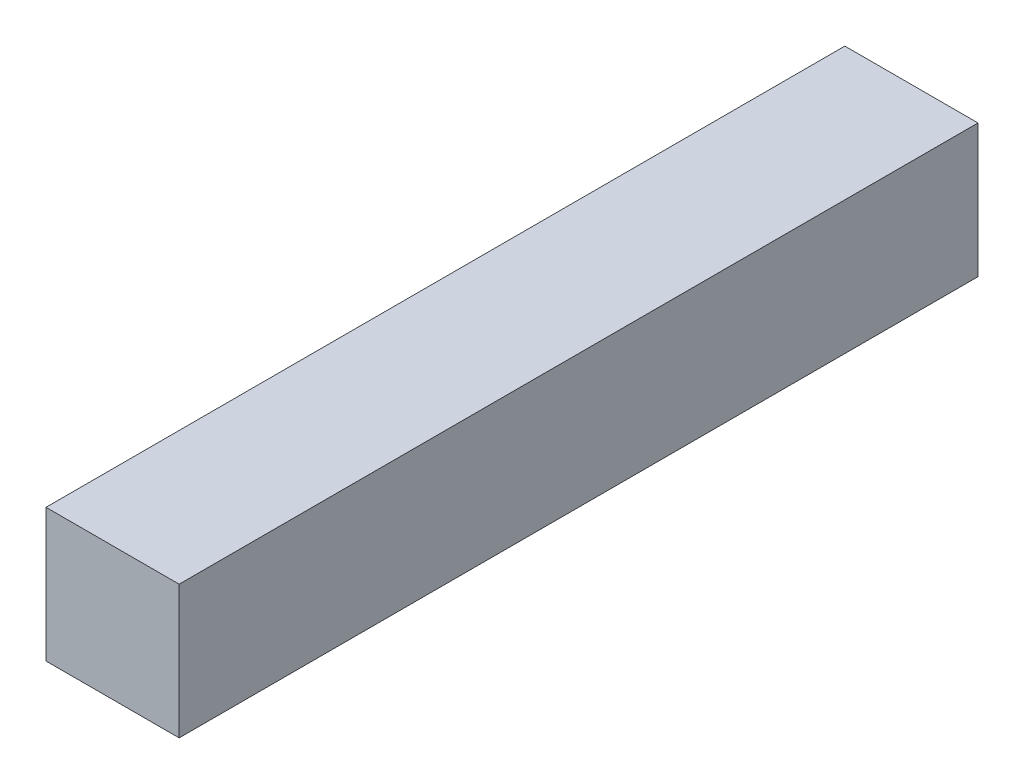
ISO-10303-21;
HEADER;
FILE_DESCRIPTION(('STEP AP214'),'2;1');
FILE_NAME('part.step','',(''),(''),'','','');
FILE_SCHEMA(('AUTOMOTIVE_DESIGN { 1 0 10303 214 1 1 1 1 }'));
ENDSEC;
DATA;
#1=APPLICATION_CONTEXT('core data for automotive mechanical design processes');
#2=APPLICATION_PROTOCOL_DEFINITION('international standard','automotive_design',2000,#1);
#3=PRODUCT_CONTEXT('',#1,'mechanical');
#4=PRODUCT('Part','Part','',(#3));
#5=PRODUCT_RELATED_PRODUCT_CATEGORY('part','',(#4));
#6=PRODUCT_DEFINITION_FORMATION('','',#4);
#7=PRODUCT_DEFINITION_CONTEXT('part definition',#1,'design');
#8=PRODUCT_DEFINITION('design','',#6,#7);
#9=PRODUCT_DEFINITION_SHAPE('','',#8);
#10=(LENGTH_UNIT() NAMED_UNIT(*) SI_UNIT(.MILLI.,.METRE.));
#11=(NAMED_UNIT(*) PLANE_ANGLE_UNIT() SI_UNIT($,.RADIAN.));
#12=(NAMED_UNIT(*) SI_UNIT($,.STERADIAN.) SOLID_ANGLE_UNIT());
#13=UNCERTAINTY_MEASURE_WITH_UNIT(LENGTH_MEASURE(1.E-05),#10,'distance_accuracy_value','');
#14=(GEOMETRIC_REPRESENTATION_CONTEXT(3) GLOBAL_UNCERTAINTY_ASSIGNED_CONTEXT((#13)) GLOBAL_UNIT_ASSIGNED_CONTEXT((#10,
#11,#12)) REPRESENTATION_CONTEXT('',''));
#15=CARTESIAN_POINT('',(0.,0.,0.));
#16=DIRECTION('',(0.,0.,1.));
#17=DIRECTION('',(1.,0.,0.));
#18=AXIS2_PLACEMENT_3D('',#15,#16,#17);
#19=CARTESIAN_POINT('',(-0.2499995,0.2499995,0.));
#20=DIRECTION('',(0.,1.,0.));
#21=DIRECTION('',(0.,0.,1.));
#22=AXIS2_PLACEMENT_3D('',#19,#20,#21);
#23=PLANE('',#22);
#24=DIRECTION('',(0.,0.,-1.));
#25=VECTOR('',#24,1.);
#26=CARTESIAN_POINT('',(0.2499995,0.2499995,0.));
#27=LINE('',#26,#25);
#28=CARTESIAN_POINT('',(0.2499995,0.2499995,0.));
#29=VERTEX_POINT('',#28);
#30=CARTESIAN_POINT('',(0.2499995,0.2499995,3.00000162));
#31=VERTEX_POINT('',#30);
#32=EDGE_CURVE('E62',#29,#31,#27,.F.);
#33=ORIENTED_EDGE('',*,*,#32,.F.);
#34=DIRECTION('',(1.,0.,0.));
#35=VECTOR('',#34,1.);
#36=CARTESIAN_POINT('',(-0.2499995,0.2499995,0.));
#37=LINE('',#36,#35);
#38=CARTESIAN_POINT('',(-0.2499995,0.2499995,0.));
#39=VERTEX_POINT('',#38);
#40=EDGE_CURVE('E20',#29,#39,#37,.F.);
#41=ORIENTED_EDGE('',*,*,#40,.T.);
#42=DIRECTION('',(0.,0.,1.));
#43=VECTOR('',#42,1.);
#44=CARTESIAN_POINT('',(-0.2499995,0.2499995,0.));
#45=LINE('',#44,#43);
#46=CARTESIAN_POINT('',(-0.2499995,0.2499995,3.00000162));
#47=VERTEX_POINT('',#46);
#48=EDGE_CURVE('E69',#47,#39,#45,.F.);
#49=ORIENTED_EDGE('',*,*,#48,.F.);
#50=DIRECTION('',(1.,0.,0.));
#51=VECTOR('',#50,1.);
#52=CARTESIAN_POINT('',(0.2499995,0.2499995,3.00000162));
#53=LINE('',#52,#51);
#54=EDGE_CURVE('E56',#31,#47,#53,.F.);
#55=ORIENTED_EDGE('',*,*,#54,.F.);
#56=EDGE_LOOP('',(#33,#41,#49,#55));
#57=FACE_BOUND('',#56,.T.);
#58=ADVANCED_FACE('F17',(#57),#23,.T.);
#59=CARTESIAN_POINT('',(0.2499995,0.2499995,0.));
#60=DIRECTION('',(1.,0.,0.));
#61=DIRECTION('',(0.,0.,-1.));
#62=AXIS2_PLACEMENT_3D('',#59,#60,#61);
#63=PLANE('',#62);
#64=DIRECTION('',(0.,0.,-1.));
#65=VECTOR('',#64,1.);
#66=CARTESIAN_POINT('',(0.2499995,-0.2499995,0.));
#67=LINE('',#66,#65);
#68=CARTESIAN_POINT('',(0.2499995,-0.2499995,0.));
#69=VERTEX_POINT('',#68);
#70=CARTESIAN_POINT('',(0.2499995,-0.2499995,3.00000162));
#71=VERTEX_POINT('',#70);
#72=EDGE_CURVE('E83',#69,#71,#67,.F.);
#73=ORIENTED_EDGE('',*,*,#72,.F.);
#74=DIRECTION('',(0.,1.,0.));
#75=VECTOR('',#74,1.);
#76=CARTESIAN_POINT('',(0.2499995,-0.2499995,0.));
#77=LINE('',#76,#75);
#78=EDGE_CURVE('E67',#69,#29,#77,.T.);
#79=ORIENTED_EDGE('',*,*,#78,.T.);
#80=ORIENTED_EDGE('',*,*,#32,.T.);
#81=DIRECTION('',(0.,1.,0.));
#82=VECTOR('',#81,1.);
#83=CARTESIAN_POINT('',(0.2499995,-0.2499995,3.00000162));
#84=LINE('',#83,#82);
#85=EDGE_CURVE('E64',#71,#31,#84,.T.);
#86=ORIENTED_EDGE('',*,*,#85,.F.);
#87=EDGE_LOOP('',(#73,#79,#80,#86));
#88=FACE_BOUND('',#87,.T.);
#89=ADVANCED_FACE('F63',(#88),#63,.T.);
#90=CARTESIAN_POINT('',(0.2499995,-0.2499995,3.00000162));
#91=DIRECTION('',(0.,0.,1.));
#92=DIRECTION('',(1.,0.,0.));
#93=AXIS2_PLACEMENT_3D('',#90,#91,#92);
#94=PLANE('',#93);
#95=DIRECTION('',(0.,1.,0.));
#96=VECTOR('',#95,1.);
#97=CARTESIAN_POINT('',(-0.2499995,-0.2499995,3.00000162));
#98=LINE('',#97,#96);
#99=CARTESIAN_POINT('',(-0.2499995,-0.2499995,3.00000162));
#100=VERTEX_POINT('',#99);
#101=EDGE_CURVE('E71',#100,#47,#98,.T.);
#102=ORIENTED_EDGE('',*,*,#101,.F.);
#103=DIRECTION('',(1.,0.,0.));
#104=VECTOR('',#103,1.);
#105=CARTESIAN_POINT('',(0.2499995,-0.2499995,3.00000162));
#106=LINE('',#105,#104);
#107=EDGE_CURVE('E75',#71,#100,#106,.F.);
#108=ORIENTED_EDGE('',*,*,#107,.F.);
#109=ORIENTED_EDGE('',*,*,#85,.T.);
#110=ORIENTED_EDGE('',*,*,#54,.T.);
#111=EDGE_LOOP('',(#102,#108,#109,#110));
#112=FACE_BOUND('',#111,.T.);
#113=ADVANCED_FACE('F73',(#112),#94,.T.);
#114=CARTESIAN_POINT('',(-0.2499995,-0.2499995,0.));
#115=DIRECTION('',(-1.,0.,0.));
#116=DIRECTION('',(0.,0.,1.));
#117=AXIS2_PLACEMENT_3D('',#114,#115,#116);
#118=PLANE('',#117);
#119=ORIENTED_EDGE('',*,*,#48,.T.);
#120=DIRECTION('',(0.,1.,0.));
#121=VECTOR('',#120,1.);
#122=CARTESIAN_POINT('',(-0.2499995,-0.2499995,0.));
#123=LINE('',#122,#121);
#124=CARTESIAN_POINT('',(-0.2499995,-0.2499995,0.));
#125=VERTEX_POINT('',#124);
#126=EDGE_CURVE('E35',#39,#125,#123,.F.);
#127=ORIENTED_EDGE('',*,*,#126,.T.);
#128=DIRECTION('',(0.,0.,-1.));
#129=VECTOR('',#128,1.);
#130=CARTESIAN_POINT('',(-0.2499995,-0.2499995,0.));
#131=LINE('',#130,#129);
#132=EDGE_CURVE('E26',#100,#125,#131,.T.);
#133=ORIENTED_EDGE('',*,*,#132,.F.);
#134=ORIENTED_EDGE('',*,*,#101,.T.);
#135=EDGE_LOOP('',(#119,#127,#133,#134));
#136=FACE_BOUND('',#135,.T.);
#137=ADVANCED_FACE('F89',(#136),#118,.T.);
#138=CARTESIAN_POINT('',(0.2499995,-0.2499995,0.));
#139=DIRECTION('',(0.,0.,1.));
#140=DIRECTION('',(1.,0.,0.));
#141=AXIS2_PLACEMENT_3D('',#138,#139,#140);
#142=PLANE('',#141);
#143=ORIENTED_EDGE('',*,*,#126,.F.);
#144=ORIENTED_EDGE('',*,*,#40,.F.);
#145=ORIENTED_EDGE('',*,*,#78,.F.);
#146=DIRECTION('',(1.,0.,0.));
#147=VECTOR('',#146,1.);
#148=CARTESIAN_POINT('',(0.2499995,-0.2499995,0.));
#149=LINE('',#148,#147);
#150=EDGE_CURVE('E11',#125,#69,#149,.T.);
#151=ORIENTED_EDGE('',*,*,#150,.F.);
#152=EDGE_LOOP('',(#143,#144,#145,#151));
#153=FACE_BOUND('',#152,.T.);
#154=ADVANCED_FACE('F91',(#153),#142,.F.);
#155=CARTESIAN_POINT('',(0.2499995,-0.2499995,0.));
#156=DIRECTION('',(0.,-1.,0.));
#157=DIRECTION('',(0.,0.,-1.));
#158=AXIS2_PLACEMENT_3D('',#155,#156,#157);
#159=PLANE('',#158);
#160=ORIENTED_EDGE('',*,*,#132,.T.);
#161=ORIENTED_EDGE('',*,*,#150,.T.);
#162=ORIENTED_EDGE('',*,*,#72,.T.);
#163=ORIENTED_EDGE('',*,*,#107,.T.);
#164=EDGE_LOOP('',(#160,#161,#162,#163));
#165=FACE_BOUND('',#164,.T.);
#166=ADVANCED_FACE('F88',(#165),#159,.T.);
#167=CLOSED_SHELL('',(#58,#89,#113,#137,#154,#166));
#168=MANIFOLD_SOLID_BREP('B1',#167);
#169=ADVANCED_BREP_SHAPE_REPRESENTATION('',(#18,#168),#14);
#170=SHAPE_DEFINITION_REPRESENTATION(#9,#169);
ENDSEC;
END-ISO-10303-21;
